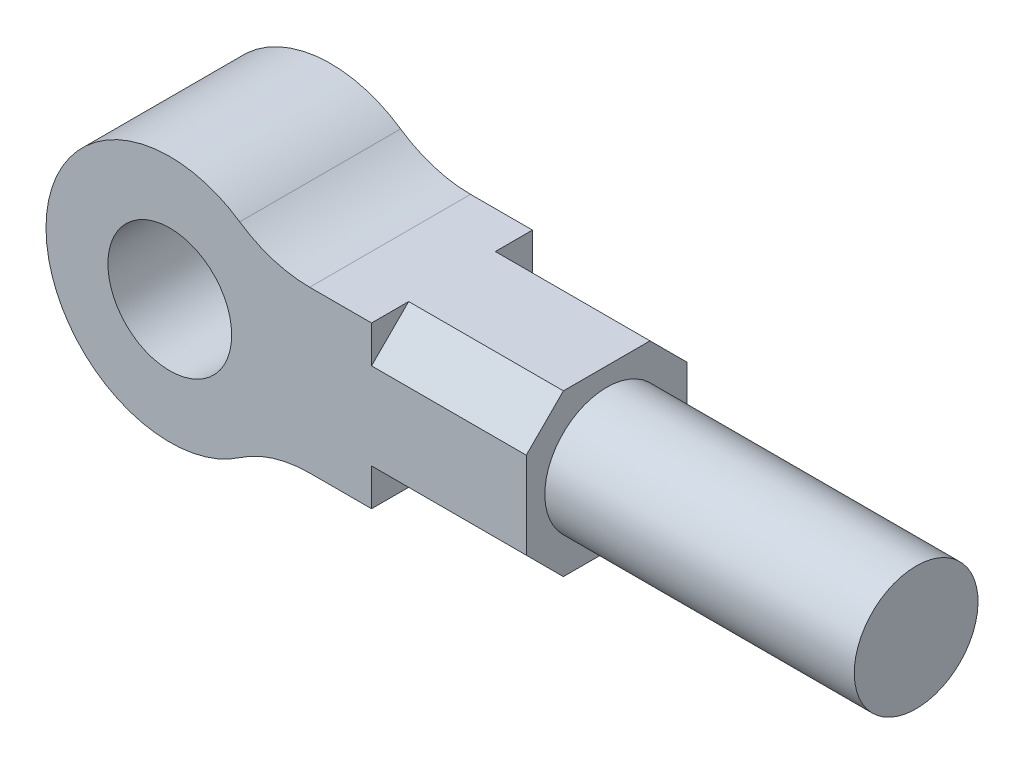
ISO-10303-21;
HEADER;
FILE_DESCRIPTION(('STEP AP214'),'2;1');
FILE_NAME('part.step','',(''),(''),'','','');
FILE_SCHEMA(('AUTOMOTIVE_DESIGN { 1 0 10303 214 1 1 1 1 }'));
ENDSEC;
DATA;
#1=APPLICATION_CONTEXT('core data for automotive mechanical design processes');
#2=APPLICATION_PROTOCOL_DEFINITION('international standard','automotive_design',2000,#1);
#3=PRODUCT_CONTEXT('',#1,'mechanical');
#4=PRODUCT('Part','Part','',(#3));
#5=PRODUCT_RELATED_PRODUCT_CATEGORY('part','',(#4));
#6=PRODUCT_DEFINITION_FORMATION('','',#4);
#7=PRODUCT_DEFINITION_CONTEXT('part definition',#1,'design');
#8=PRODUCT_DEFINITION('design','',#6,#7);
#9=PRODUCT_DEFINITION_SHAPE('','',#8);
#10=(LENGTH_UNIT() NAMED_UNIT(*) SI_UNIT(.MILLI.,.METRE.));
#11=(NAMED_UNIT(*) PLANE_ANGLE_UNIT() SI_UNIT($,.RADIAN.));
#12=(NAMED_UNIT(*) SI_UNIT($,.STERADIAN.) SOLID_ANGLE_UNIT());
#13=UNCERTAINTY_MEASURE_WITH_UNIT(LENGTH_MEASURE(1.E-05),#10,'distance_accuracy_value','');
#14=(GEOMETRIC_REPRESENTATION_CONTEXT(3) GLOBAL_UNCERTAINTY_ASSIGNED_CONTEXT((#13)) GLOBAL_UNIT_ASSIGNED_CONTEXT((#10,
#11,#12)) REPRESENTATION_CONTEXT('',''));
#15=CARTESIAN_POINT('',(0.,0.,0.));
#16=DIRECTION('',(0.,0.,1.));
#17=DIRECTION('',(1.,0.,0.));
#18=AXIS2_PLACEMENT_3D('',#15,#16,#17);
#19=CARTESIAN_POINT('',(22.6053091109146,-33.,13.));
#20=DIRECTION('',(0.,0.,1.));
#21=DIRECTION('',(1.,0.,0.));
#22=AXIS2_PLACEMENT_3D('',#19,#20,#21);
#23=PLANE('',#22);
#24=DIRECTION('',(1.,0.,0.));
#25=VECTOR('',#24,1.);
#26=CARTESIAN_POINT('',(32.6053091109146,6.99999999999963,13.));
#27=LINE('',#26,#25);
#28=CARTESIAN_POINT('',(32.6053091109146,6.99999999999963,13.));
#29=VERTEX_POINT('',#28);
#30=CARTESIAN_POINT('',(57.6053091109146,6.9999999999996,13.));
#31=VERTEX_POINT('',#30);
#32=EDGE_CURVE('E267',#29,#31,#27,.T.);
#33=ORIENTED_EDGE('',*,*,#32,.F.);
#34=DIRECTION('',(0.,-1.,0.));
#35=VECTOR('',#34,1.);
#36=CARTESIAN_POINT('',(32.6053091109147,12.9999999999996,13.));
#37=LINE('',#36,#35);
#38=CARTESIAN_POINT('',(32.6053091109147,12.9999999999996,13.));
#39=VERTEX_POINT('',#38);
#40=EDGE_CURVE('E263',#39,#29,#37,.T.);
#41=ORIENTED_EDGE('',*,*,#40,.F.);
#42=DIRECTION('',(-1.,0.,0.));
#43=VECTOR('',#42,1.);
#44=CARTESIAN_POINT('',(22.6053091109146,13.,13.));
#45=LINE('',#44,#43);
#46=CARTESIAN_POINT('',(22.6053091109146,13.,13.));
#47=VERTEX_POINT('',#46);
#48=EDGE_CURVE('E214',#39,#47,#45,.T.);
#49=ORIENTED_EDGE('',*,*,#48,.T.);
#50=CARTESIAN_POINT('',(22.6053091109146,33.,13.));
#51=DIRECTION('',(0.,0.,-1.));
#52=DIRECTION('',(-1.,0.,0.));
#53=AXIS2_PLACEMENT_3D('',#50,#51,#52);
#54=CIRCLE('',#53,20.);
#55=CARTESIAN_POINT('',(11.3026545554573,16.5,13.));
#56=VERTEX_POINT('',#55);
#57=EDGE_CURVE('E211',#47,#56,#54,.T.);
#58=ORIENTED_EDGE('',*,*,#57,.T.);
#59=CARTESIAN_POINT('',(0.,0.,13.));
#60=DIRECTION('',(0.,0.,1.));
#61=DIRECTION('',(1.,0.,0.));
#62=AXIS2_PLACEMENT_3D('',#59,#60,#61);
#63=CIRCLE('',#62,20.);
#64=CARTESIAN_POINT('',(11.3026545554573,-16.5,13.));
#65=VERTEX_POINT('',#64);
#66=EDGE_CURVE('E187',#56,#65,#63,.T.);
#67=ORIENTED_EDGE('',*,*,#66,.T.);
#68=CARTESIAN_POINT('',(22.6053091109146,-33.,13.));
#69=DIRECTION('',(0.,0.,-1.));
#70=DIRECTION('',(1.,0.,0.));
#71=AXIS2_PLACEMENT_3D('',#68,#69,#70);
#72=CIRCLE('',#71,20.);
#73=CARTESIAN_POINT('',(22.6053091109146,-13.,13.));
#74=VERTEX_POINT('',#73);
#75=EDGE_CURVE('E191',#65,#74,#72,.T.);
#76=ORIENTED_EDGE('',*,*,#75,.T.);
#77=DIRECTION('',(1.,0.,0.));
#78=VECTOR('',#77,1.);
#79=CARTESIAN_POINT('',(22.6053091109146,-13.,13.));
#80=LINE('',#79,#78);
#81=CARTESIAN_POINT('',(32.6053091109146,-13.,13.));
#82=VERTEX_POINT('',#81);
#83=EDGE_CURVE('E221',#74,#82,#80,.T.);
#84=ORIENTED_EDGE('',*,*,#83,.T.);
#85=DIRECTION('',(0.,-1.,0.));
#86=VECTOR('',#85,1.);
#87=CARTESIAN_POINT('',(32.6053091109146,0.,13.));
#88=LINE('',#87,#86);
#89=CARTESIAN_POINT('',(32.6053091109146,-6.99999999999997,13.));
#90=VERTEX_POINT('',#89);
#91=EDGE_CURVE('E286',#90,#82,#88,.T.);
#92=ORIENTED_EDGE('',*,*,#91,.F.);
#93=DIRECTION('',(1.,0.,0.));
#94=VECTOR('',#93,1.);
#95=CARTESIAN_POINT('',(32.6053091109146,-6.99999999999997,13.));
#96=LINE('',#95,#94);
#97=CARTESIAN_POINT('',(57.6053091109146,-7.,13.));
#98=VERTEX_POINT('',#97);
#99=EDGE_CURVE('E270',#90,#98,#96,.T.);
#100=ORIENTED_EDGE('',*,*,#99,.T.);
#101=DIRECTION('',(0.,1.,0.));
#102=VECTOR('',#101,1.);
#103=CARTESIAN_POINT('',(57.6053091109147,13.,13.));
#104=LINE('',#103,#102);
#105=EDGE_CURVE('E217',#98,#31,#104,.T.);
#106=ORIENTED_EDGE('',*,*,#105,.T.);
#107=EDGE_LOOP('',(#33,#41,#49,#58,#67,#76,#84,#92,#100,#106));
#108=FACE_BOUND('',#107,.T.);
#109=CARTESIAN_POINT('',(0.,0.,13.));
#110=DIRECTION('',(0.,0.,1.));
#111=DIRECTION('',(1.,0.,0.));
#112=AXIS2_PLACEMENT_3D('',#109,#110,#111);
#113=CIRCLE('',#112,10.);
#114=CARTESIAN_POINT('',(10.,0.,13.));
#115=VERTEX_POINT('',#114);
#116=EDGE_CURVE('E208',#115,#115,#113,.T.);
#117=ORIENTED_EDGE('',*,*,#116,.F.);
#118=EDGE_LOOP('',(#117));
#119=FACE_BOUND('',#118,.T.);
#120=ADVANCED_FACE('F41',(#108,#119),#23,.T.);
#121=CARTESIAN_POINT('',(22.6053091109146,-33.,-13.));
#122=DIRECTION('',(0.,0.,1.));
#123=DIRECTION('',(1.,0.,0.));
#124=AXIS2_PLACEMENT_3D('',#121,#122,#123);
#125=PLANE('',#124);
#126=DIRECTION('',(0.,1.,0.));
#127=VECTOR('',#126,1.);
#128=CARTESIAN_POINT('',(57.6053091109147,13.,-13.));
#129=LINE('',#128,#127);
#130=CARTESIAN_POINT('',(57.6053091109146,-7.00000000000037,-13.));
#131=VERTEX_POINT('',#130);
#132=CARTESIAN_POINT('',(57.6053091109146,6.99999999999996,-13.));
#133=VERTEX_POINT('',#132);
#134=EDGE_CURVE('E198',#131,#133,#129,.T.);
#135=ORIENTED_EDGE('',*,*,#134,.F.);
#136=DIRECTION('',(1.,0.,0.));
#137=VECTOR('',#136,1.);
#138=CARTESIAN_POINT('',(32.6053091109146,-7.00000000000034,-13.));
#139=LINE('',#138,#137);
#140=CARTESIAN_POINT('',(32.6053091109146,-7.00000000000034,-13.));
#141=VERTEX_POINT('',#140);
#142=EDGE_CURVE('E66',#141,#131,#139,.T.);
#143=ORIENTED_EDGE('',*,*,#142,.F.);
#144=DIRECTION('',(0.,1.,0.));
#145=VECTOR('',#144,1.);
#146=CARTESIAN_POINT('',(32.6053091109146,0.,-13.));
#147=LINE('',#146,#145);
#148=CARTESIAN_POINT('',(32.6053091109146,-13.,-13.));
#149=VERTEX_POINT('',#148);
#150=EDGE_CURVE('E152',#149,#141,#147,.T.);
#151=ORIENTED_EDGE('',*,*,#150,.F.);
#152=DIRECTION('',(1.,0.,0.));
#153=VECTOR('',#152,1.);
#154=CARTESIAN_POINT('',(22.6053091109146,-13.,-13.));
#155=LINE('',#154,#153);
#156=CARTESIAN_POINT('',(22.6053091109146,-13.,-13.));
#157=VERTEX_POINT('',#156);
#158=EDGE_CURVE('E201',#157,#149,#155,.T.);
#159=ORIENTED_EDGE('',*,*,#158,.F.);
#160=CARTESIAN_POINT('',(22.6053091109146,-33.,-13.));
#161=DIRECTION('',(0.,0.,-1.));
#162=DIRECTION('',(1.,0.,0.));
#163=AXIS2_PLACEMENT_3D('',#160,#161,#162);
#164=CIRCLE('',#163,20.);
#165=CARTESIAN_POINT('',(11.3026545554573,-16.5,-13.));
#166=VERTEX_POINT('',#165);
#167=EDGE_CURVE('E204',#166,#157,#164,.T.);
#168=ORIENTED_EDGE('',*,*,#167,.F.);
#169=CARTESIAN_POINT('',(0.,0.,-13.));
#170=DIRECTION('',(0.,0.,1.));
#171=DIRECTION('',(1.,0.,0.));
#172=AXIS2_PLACEMENT_3D('',#169,#170,#171);
#173=CIRCLE('',#172,20.);
#174=CARTESIAN_POINT('',(11.3026545554573,16.5,-13.));
#175=VERTEX_POINT('',#174);
#176=EDGE_CURVE('E188',#175,#166,#173,.T.);
#177=ORIENTED_EDGE('',*,*,#176,.F.);
#178=CARTESIAN_POINT('',(22.6053091109146,33.,-13.));
#179=DIRECTION('',(0.,0.,-1.));
#180=DIRECTION('',(-1.,0.,0.));
#181=AXIS2_PLACEMENT_3D('',#178,#179,#180);
#182=CIRCLE('',#181,20.);
#183=CARTESIAN_POINT('',(22.6053091109146,13.,-13.));
#184=VERTEX_POINT('',#183);
#185=EDGE_CURVE('E192',#184,#175,#182,.T.);
#186=ORIENTED_EDGE('',*,*,#185,.F.);
#187=DIRECTION('',(-1.,0.,0.));
#188=VECTOR('',#187,1.);
#189=CARTESIAN_POINT('',(22.6053091109146,13.,-13.));
#190=LINE('',#189,#188);
#191=CARTESIAN_POINT('',(32.6053091109147,13.,-13.));
#192=VERTEX_POINT('',#191);
#193=EDGE_CURVE('E195',#192,#184,#190,.T.);
#194=ORIENTED_EDGE('',*,*,#193,.F.);
#195=DIRECTION('',(0.,1.,0.));
#196=VECTOR('',#195,1.);
#197=CARTESIAN_POINT('',(32.6053091109146,0.,-13.));
#198=LINE('',#197,#196);
#199=CARTESIAN_POINT('',(32.6053091109146,6.99999999999999,-13.));
#200=VERTEX_POINT('',#199);
#201=EDGE_CURVE('E239',#200,#192,#198,.T.);
#202=ORIENTED_EDGE('',*,*,#201,.F.);
#203=DIRECTION('',(1.,0.,0.));
#204=VECTOR('',#203,1.);
#205=CARTESIAN_POINT('',(32.6053091109146,6.99999999999999,-13.));
#206=LINE('',#205,#204);
#207=EDGE_CURVE('E232',#200,#133,#206,.T.);
#208=ORIENTED_EDGE('',*,*,#207,.T.);
#209=EDGE_LOOP('',(#135,#143,#151,#159,#168,#177,#186,#194,#202,#208));
#210=FACE_BOUND('',#209,.T.);
#211=CARTESIAN_POINT('',(0.,0.,-13.));
#212=DIRECTION('',(0.,0.,1.));
#213=DIRECTION('',(1.,0.,0.));
#214=AXIS2_PLACEMENT_3D('',#211,#212,#213);
#215=CIRCLE('',#214,10.);
#216=CARTESIAN_POINT('',(10.,0.,-13.));
#217=VERTEX_POINT('',#216);
#218=EDGE_CURVE('E228',#217,#217,#215,.T.);
#219=ORIENTED_EDGE('',*,*,#218,.T.);
#220=EDGE_LOOP('',(#219));
#221=FACE_BOUND('',#220,.T.);
#222=ADVANCED_FACE('F330',(#210,#221),#125,.F.);
#223=CARTESIAN_POINT('',(22.6053091109146,-33.,13.));
#224=DIRECTION('',(0.,0.,-1.));
#225=DIRECTION('',(-1.,0.,0.));
#226=AXIS2_PLACEMENT_3D('',#223,#224,#225);
#227=CYLINDRICAL_SURFACE('',#226,20.);
#228=ORIENTED_EDGE('',*,*,#167,.T.);
#229=DIRECTION('',(0.,0.,-1.));
#230=VECTOR('',#229,1.);
#231=CARTESIAN_POINT('',(22.6053091109146,-13.,13.));
#232=LINE('',#231,#230);
#233=EDGE_CURVE('E45',#74,#157,#232,.T.);
#234=ORIENTED_EDGE('',*,*,#233,.F.);
#235=ORIENTED_EDGE('',*,*,#75,.F.);
#236=DIRECTION('',(0.,0.,-1.));
#237=VECTOR('',#236,1.);
#238=CARTESIAN_POINT('',(11.3026545554573,-16.5,13.));
#239=LINE('',#238,#237);
#240=EDGE_CURVE('E183',#65,#166,#239,.T.);
#241=ORIENTED_EDGE('',*,*,#240,.T.);
#242=EDGE_LOOP('',(#228,#234,#235,#241));
#243=FACE_BOUND('',#242,.T.);
#244=ADVANCED_FACE('F43',(#243),#227,.F.);
#245=CARTESIAN_POINT('',(22.6053091109146,-13.,13.));
#246=DIRECTION('',(0.,1.,0.));
#247=DIRECTION('',(-1.,0.,0.));
#248=AXIS2_PLACEMENT_3D('',#245,#246,#247);
#249=PLANE('',#248);
#250=DIRECTION('',(0.,0.,-1.));
#251=VECTOR('',#250,1.);
#252=CARTESIAN_POINT('',(57.6053091109146,-13.,13.));
#253=LINE('',#252,#251);
#254=CARTESIAN_POINT('',(57.6053091109146,-13.,6.99999999999998));
#255=VERTEX_POINT('',#254);
#256=CARTESIAN_POINT('',(57.6053091109146,-13.,-7.00000000000036));
#257=VERTEX_POINT('',#256);
#258=EDGE_CURVE('E158',#255,#257,#253,.T.);
#259=ORIENTED_EDGE('',*,*,#258,.F.);
#260=DIRECTION('',(1.,0.,0.));
#261=VECTOR('',#260,1.);
#262=CARTESIAN_POINT('',(32.6053091109146,-13.,6.99999999999998));
#263=LINE('',#262,#261);
#264=CARTESIAN_POINT('',(32.6053091109146,-13.,6.99999999999998));
#265=VERTEX_POINT('',#264);
#266=EDGE_CURVE('E58',#265,#255,#263,.T.);
#267=ORIENTED_EDGE('',*,*,#266,.F.);
#268=DIRECTION('',(0.,0.,-1.));
#269=VECTOR('',#268,1.);
#270=CARTESIAN_POINT('',(32.6053091109146,-13.,0.));
#271=LINE('',#270,#269);
#272=EDGE_CURVE('E278',#82,#265,#271,.T.);
#273=ORIENTED_EDGE('',*,*,#272,.F.);
#274=ORIENTED_EDGE('',*,*,#83,.F.);
#275=ORIENTED_EDGE('',*,*,#233,.T.);
#276=ORIENTED_EDGE('',*,*,#158,.T.);
#277=DIRECTION('',(0.,0.,-1.));
#278=VECTOR('',#277,1.);
#279=CARTESIAN_POINT('',(32.6053091109146,-13.,0.));
#280=LINE('',#279,#278);
#281=CARTESIAN_POINT('',(32.6053091109146,-13.,-7.00000000000036));
#282=VERTEX_POINT('',#281);
#283=EDGE_CURVE('E160',#282,#149,#280,.T.);
#284=ORIENTED_EDGE('',*,*,#283,.F.);
#285=DIRECTION('',(1.,0.,0.));
#286=VECTOR('',#285,1.);
#287=CARTESIAN_POINT('',(32.6053091109146,-13.,-7.00000000000036));
#288=LINE('',#287,#286);
#289=EDGE_CURVE('E144',#282,#257,#288,.T.);
#290=ORIENTED_EDGE('',*,*,#289,.T.);
#291=EDGE_LOOP('',(#259,#267,#273,#274,#275,#276,#284,#290));
#292=FACE_BOUND('',#291,.T.);
#293=ADVANCED_FACE('F157',(#292),#249,.F.);
#294=CARTESIAN_POINT('',(57.6053091109147,13.,13.));
#295=DIRECTION('',(-1.,0.,0.));
#296=DIRECTION('',(0.,-1.,0.));
#297=AXIS2_PLACEMENT_3D('',#294,#295,#296);
#298=PLANE('',#297);
#299=CARTESIAN_POINT('',(57.6053091109146,0.,0.));
#300=DIRECTION('',(1.,0.,0.));
#301=DIRECTION('',(0.,1.,0.));
#302=AXIS2_PLACEMENT_3D('',#299,#300,#301);
#303=CIRCLE('',#302,10.);
#304=CARTESIAN_POINT('',(57.6053091109146,9.99999999999994,0.));
#305=VERTEX_POINT('',#304);
#306=EDGE_CURVE('E11',#305,#305,#303,.T.);
#307=ORIENTED_EDGE('',*,*,#306,.F.);
#308=EDGE_LOOP('',(#307));
#309=FACE_BOUND('',#308,.T.);
#310=DIRECTION('',(0.,0.,-1.));
#311=VECTOR('',#310,1.);
#312=CARTESIAN_POINT('',(57.6053091109147,13.,13.));
#313=LINE('',#312,#311);
#314=CARTESIAN_POINT('',(57.6053091109147,12.9999999999996,6.99999999999998));
#315=VERTEX_POINT('',#314);
#316=CARTESIAN_POINT('',(57.6053091109147,13.,-7.));
#317=VERTEX_POINT('',#316);
#318=EDGE_CURVE('E168',#315,#317,#313,.T.);
#319=ORIENTED_EDGE('',*,*,#318,.F.);
#320=DIRECTION('',(0.,0.707106781186548,-0.707106781186547));
#321=VECTOR('',#320,1.);
#322=CARTESIAN_POINT('',(57.6053091109146,6.9999999999996,13.));
#323=LINE('',#322,#321);
#324=EDGE_CURVE('E259',#31,#315,#323,.T.);
#325=ORIENTED_EDGE('',*,*,#324,.F.);
#326=ORIENTED_EDGE('',*,*,#105,.F.);
#327=DIRECTION('',(0.,0.707106781186547,0.707106781186548));
#328=VECTOR('',#327,1.);
#329=CARTESIAN_POINT('',(57.6053091109146,-10.,9.99999999999997));
#330=LINE('',#329,#328);
#331=EDGE_CURVE('E162',#255,#98,#330,.T.);
#332=ORIENTED_EDGE('',*,*,#331,.F.);
#333=ORIENTED_EDGE('',*,*,#258,.T.);
#334=DIRECTION('',(0.,-0.707106781186548,0.707106781186548));
#335=VECTOR('',#334,1.);
#336=CARTESIAN_POINT('',(57.6053091109146,-10.0000000000002,-10.0000000000002));
#337=LINE('',#336,#335);
#338=EDGE_CURVE('E141',#131,#257,#337,.T.);
#339=ORIENTED_EDGE('',*,*,#338,.F.);
#340=ORIENTED_EDGE('',*,*,#134,.T.);
#341=DIRECTION('',(0.,-0.707106781186548,-0.707106781186547));
#342=VECTOR('',#341,1.);
#343=CARTESIAN_POINT('',(57.6053091109146,9.99999999999995,-10.));
#344=LINE('',#343,#342);
#345=EDGE_CURVE('E151',#317,#133,#344,.T.);
#346=ORIENTED_EDGE('',*,*,#345,.F.);
#347=EDGE_LOOP('',(#319,#325,#326,#332,#333,#339,#340,#346));
#348=FACE_BOUND('',#347,.T.);
#349=ADVANCED_FACE('F165',(#309,#348),#298,.F.);
#350=CARTESIAN_POINT('',(22.6053091109146,13.,13.));
#351=DIRECTION('',(0.,-1.,0.));
#352=DIRECTION('',(1.,0.,0.));
#353=AXIS2_PLACEMENT_3D('',#350,#351,#352);
#354=PLANE('',#353);
#355=DIRECTION('',(0.,0.,-1.));
#356=VECTOR('',#355,1.);
#357=CARTESIAN_POINT('',(32.6053091109147,12.9999999999996,13.));
#358=LINE('',#357,#356);
#359=CARTESIAN_POINT('',(32.6053091109147,13.,6.99999999999998));
#360=VERTEX_POINT('',#359);
#361=EDGE_CURVE('E255',#39,#360,#358,.T.);
#362=ORIENTED_EDGE('',*,*,#361,.T.);
#363=DIRECTION('',(1.,0.,0.));
#364=VECTOR('',#363,1.);
#365=CARTESIAN_POINT('',(32.6053091109147,12.9999999999996,6.99999999999998));
#366=LINE('',#365,#364);
#367=EDGE_CURVE('E273',#360,#315,#366,.T.);
#368=ORIENTED_EDGE('',*,*,#367,.T.);
#369=ORIENTED_EDGE('',*,*,#318,.T.);
#370=DIRECTION('',(1.,0.,0.));
#371=VECTOR('',#370,1.);
#372=CARTESIAN_POINT('',(32.6053091109147,13.,-7.));
#373=LINE('',#372,#371);
#374=CARTESIAN_POINT('',(32.6053091109147,13.,-7.));
#375=VERTEX_POINT('',#374);
#376=EDGE_CURVE('E236',#375,#317,#373,.T.);
#377=ORIENTED_EDGE('',*,*,#376,.F.);
#378=DIRECTION('',(0.,0.,1.));
#379=VECTOR('',#378,1.);
#380=CARTESIAN_POINT('',(32.6053091109147,13.,0.));
#381=LINE('',#380,#379);
#382=EDGE_CURVE('E245',#192,#375,#381,.T.);
#383=ORIENTED_EDGE('',*,*,#382,.F.);
#384=ORIENTED_EDGE('',*,*,#193,.T.);
#385=DIRECTION('',(0.,0.,-1.));
#386=VECTOR('',#385,1.);
#387=CARTESIAN_POINT('',(22.6053091109146,13.,13.));
#388=LINE('',#387,#386);
#389=EDGE_CURVE('E173',#47,#184,#388,.T.);
#390=ORIENTED_EDGE('',*,*,#389,.F.);
#391=ORIENTED_EDGE('',*,*,#48,.F.);
#392=EDGE_LOOP('',(#362,#368,#369,#377,#383,#384,#390,#391));
#393=FACE_BOUND('',#392,.T.);
#394=ADVANCED_FACE('F320',(#393),#354,.F.);
#395=CARTESIAN_POINT('',(22.6053091109146,33.,13.));
#396=DIRECTION('',(0.,0.,-1.));
#397=DIRECTION('',(-1.,0.,0.));
#398=AXIS2_PLACEMENT_3D('',#395,#396,#397);
#399=CYLINDRICAL_SURFACE('',#398,20.);
#400=ORIENTED_EDGE('',*,*,#185,.T.);
#401=DIRECTION('',(0.,0.,-1.));
#402=VECTOR('',#401,1.);
#403=CARTESIAN_POINT('',(11.3026545554573,16.5,13.));
#404=LINE('',#403,#402);
#405=EDGE_CURVE('E179',#56,#175,#404,.T.);
#406=ORIENTED_EDGE('',*,*,#405,.F.);
#407=ORIENTED_EDGE('',*,*,#57,.F.);
#408=ORIENTED_EDGE('',*,*,#389,.T.);
#409=EDGE_LOOP('',(#400,#406,#407,#408));
#410=FACE_BOUND('',#409,.T.);
#411=ADVANCED_FACE('F326',(#410),#399,.F.);
#412=CARTESIAN_POINT('',(0.,0.,13.));
#413=DIRECTION('',(0.,0.,-1.));
#414=DIRECTION('',(-1.,0.,0.));
#415=AXIS2_PLACEMENT_3D('',#412,#413,#414);
#416=CYLINDRICAL_SURFACE('',#415,20.);
#417=ORIENTED_EDGE('',*,*,#176,.T.);
#418=ORIENTED_EDGE('',*,*,#240,.F.);
#419=ORIENTED_EDGE('',*,*,#66,.F.);
#420=ORIENTED_EDGE('',*,*,#405,.T.);
#421=EDGE_LOOP('',(#417,#418,#419,#420));
#422=FACE_BOUND('',#421,.T.);
#423=ADVANCED_FACE('F344',(#422),#416,.T.);
#424=CARTESIAN_POINT('',(0.,0.,13.));
#425=DIRECTION('',(0.,0.,-1.));
#426=DIRECTION('',(-1.,0.,0.));
#427=AXIS2_PLACEMENT_3D('',#424,#425,#426);
#428=CYLINDRICAL_SURFACE('',#427,10.);
#429=ORIENTED_EDGE('',*,*,#116,.T.);
#430=EDGE_LOOP('',(#429));
#431=FACE_BOUND('',#430,.T.);
#432=ORIENTED_EDGE('',*,*,#218,.F.);
#433=EDGE_LOOP('',(#432));
#434=FACE_BOUND('',#433,.T.);
#435=ADVANCED_FACE('F341',(#431,#434),#428,.F.);
#436=CARTESIAN_POINT('',(32.6053091109146,9.99999999999998,-10.));
#437=DIRECTION('',(0.,-0.707106781186547,0.707106781186548));
#438=DIRECTION('',(0.,-0.707106781186548,-0.707106781186547));
#439=AXIS2_PLACEMENT_3D('',#436,#437,#438);
#440=PLANE('',#439);
#441=ORIENTED_EDGE('',*,*,#345,.T.);
#442=ORIENTED_EDGE('',*,*,#207,.F.);
#443=DIRECTION('',(0.,-0.707106781186548,-0.707106781186547));
#444=VECTOR('',#443,1.);
#445=CARTESIAN_POINT('',(32.6053091109146,9.99999999999998,-10.));
#446=LINE('',#445,#444);
#447=EDGE_CURVE('E248',#375,#200,#446,.T.);
#448=ORIENTED_EDGE('',*,*,#447,.F.);
#449=ORIENTED_EDGE('',*,*,#376,.T.);
#450=EDGE_LOOP('',(#441,#442,#448,#449));
#451=FACE_BOUND('',#450,.T.);
#452=ADVANCED_FACE('F375',(#451),#440,.F.);
#453=CARTESIAN_POINT('',(32.6053091109146,0.,0.));
#454=DIRECTION('',(1.,0.,0.));
#455=DIRECTION('',(0.,1.,0.));
#456=AXIS2_PLACEMENT_3D('',#453,#454,#455);
#457=PLANE('',#456);
#458=ORIENTED_EDGE('',*,*,#382,.T.);
#459=ORIENTED_EDGE('',*,*,#447,.T.);
#460=ORIENTED_EDGE('',*,*,#201,.T.);
#461=EDGE_LOOP('',(#458,#459,#460));
#462=FACE_BOUND('',#461,.T.);
#463=ADVANCED_FACE('F373',(#462),#457,.T.);
#464=CARTESIAN_POINT('',(32.6053091109146,6.99999999999963,13.));
#465=DIRECTION('',(0.,-0.707106781186547,-0.707106781186548));
#466=DIRECTION('',(0.,0.707106781186548,-0.707106781186547));
#467=AXIS2_PLACEMENT_3D('',#464,#465,#466);
#468=PLANE('',#467);
#469=ORIENTED_EDGE('',*,*,#324,.T.);
#470=ORIENTED_EDGE('',*,*,#367,.F.);
#471=DIRECTION('',(0.,0.707106781186548,-0.707106781186547));
#472=VECTOR('',#471,1.);
#473=CARTESIAN_POINT('',(32.6053091109146,6.99999999999963,13.));
#474=LINE('',#473,#472);
#475=EDGE_CURVE('E260',#29,#360,#474,.T.);
#476=ORIENTED_EDGE('',*,*,#475,.F.);
#477=ORIENTED_EDGE('',*,*,#32,.T.);
#478=EDGE_LOOP('',(#469,#470,#476,#477));
#479=FACE_BOUND('',#478,.T.);
#480=ADVANCED_FACE('F380',(#479),#468,.F.);
#481=CARTESIAN_POINT('',(32.6053091109146,0.,0.));
#482=DIRECTION('',(-1.,0.,0.));
#483=DIRECTION('',(0.,-1.,0.));
#484=AXIS2_PLACEMENT_3D('',#481,#482,#483);
#485=PLANE('',#484);
#486=ORIENTED_EDGE('',*,*,#361,.F.);
#487=ORIENTED_EDGE('',*,*,#40,.T.);
#488=ORIENTED_EDGE('',*,*,#475,.T.);
#489=EDGE_LOOP('',(#486,#487,#488));
#490=FACE_BOUND('',#489,.T.);
#491=ADVANCED_FACE('F395',(#490),#485,.F.);
#492=CARTESIAN_POINT('',(32.6053091109146,-10.0000000000002,-10.0000000000002));
#493=DIRECTION('',(0.,0.707106781186548,0.707106781186548));
#494=DIRECTION('',(0.,-0.707106781186548,0.707106781186548));
#495=AXIS2_PLACEMENT_3D('',#492,#493,#494);
#496=PLANE('',#495);
#497=ORIENTED_EDGE('',*,*,#338,.T.);
#498=ORIENTED_EDGE('',*,*,#289,.F.);
#499=DIRECTION('',(0.,-0.707106781186548,0.707106781186548));
#500=VECTOR('',#499,1.);
#501=CARTESIAN_POINT('',(32.6053091109146,-10.0000000000002,-10.0000000000002));
#502=LINE('',#501,#500);
#503=EDGE_CURVE('E299',#141,#282,#502,.T.);
#504=ORIENTED_EDGE('',*,*,#503,.F.);
#505=ORIENTED_EDGE('',*,*,#142,.T.);
#506=EDGE_LOOP('',(#497,#498,#504,#505));
#507=FACE_BOUND('',#506,.T.);
#508=ADVANCED_FACE('F143',(#507),#496,.F.);
#509=CARTESIAN_POINT('',(32.6053091109146,0.,0.));
#510=DIRECTION('',(1.,0.,0.));
#511=DIRECTION('',(0.,1.,0.));
#512=AXIS2_PLACEMENT_3D('',#509,#510,#511);
#513=PLANE('',#512);
#514=ORIENTED_EDGE('',*,*,#150,.T.);
#515=ORIENTED_EDGE('',*,*,#503,.T.);
#516=ORIENTED_EDGE('',*,*,#283,.T.);
#517=EDGE_LOOP('',(#514,#515,#516));
#518=FACE_BOUND('',#517,.T.);
#519=ADVANCED_FACE('F389',(#518),#513,.T.);
#520=CARTESIAN_POINT('',(32.6053091109146,-10.,9.99999999999997));
#521=DIRECTION('',(0.,0.707106781186548,-0.707106781186547));
#522=DIRECTION('',(0.,0.707106781186547,0.707106781186548));
#523=AXIS2_PLACEMENT_3D('',#520,#521,#522);
#524=PLANE('',#523);
#525=ORIENTED_EDGE('',*,*,#331,.T.);
#526=ORIENTED_EDGE('',*,*,#99,.F.);
#527=DIRECTION('',(0.,0.707106781186547,0.707106781186548));
#528=VECTOR('',#527,1.);
#529=CARTESIAN_POINT('',(32.6053091109146,-10.,9.99999999999997));
#530=LINE('',#529,#528);
#531=EDGE_CURVE('E282',#265,#90,#530,.T.);
#532=ORIENTED_EDGE('',*,*,#531,.F.);
#533=ORIENTED_EDGE('',*,*,#266,.T.);
#534=EDGE_LOOP('',(#525,#526,#532,#533));
#535=FACE_BOUND('',#534,.T.);
#536=ADVANCED_FACE('F381',(#535),#524,.F.);
#537=CARTESIAN_POINT('',(32.6053091109146,0.,0.));
#538=DIRECTION('',(1.,0.,0.));
#539=DIRECTION('',(0.,1.,0.));
#540=AXIS2_PLACEMENT_3D('',#537,#538,#539);
#541=PLANE('',#540);
#542=ORIENTED_EDGE('',*,*,#272,.T.);
#543=ORIENTED_EDGE('',*,*,#531,.T.);
#544=ORIENTED_EDGE('',*,*,#91,.T.);
#545=EDGE_LOOP('',(#542,#543,#544));
#546=FACE_BOUND('',#545,.T.);
#547=ADVANCED_FACE('F315',(#546),#541,.T.);
#548=CARTESIAN_POINT('',(107.605309110915,-1.14871049756581E-13,0.));
#549=DIRECTION('',(-1.,0.,0.));
#550=DIRECTION('',(0.,-1.,0.));
#551=AXIS2_PLACEMENT_3D('',#548,#549,#550);
#552=CYLINDRICAL_SURFACE('',#551,10.);
#553=CARTESIAN_POINT('',(107.605309110915,-1.14871049756581E-13,0.));
#554=DIRECTION('',(1.,0.,0.));
#555=DIRECTION('',(0.,1.,0.));
#556=AXIS2_PLACEMENT_3D('',#553,#554,#555);
#557=CIRCLE('',#556,10.);
#558=CARTESIAN_POINT('',(107.605309110915,9.99999999999989,0.));
#559=VERTEX_POINT('',#558);
#560=EDGE_CURVE('E277',#559,#559,#557,.T.);
#561=ORIENTED_EDGE('',*,*,#560,.F.);
#562=EDGE_LOOP('',(#561));
#563=FACE_BOUND('',#562,.T.);
#564=ORIENTED_EDGE('',*,*,#306,.T.);
#565=EDGE_LOOP('',(#564));
#566=FACE_BOUND('',#565,.T.);
#567=ADVANCED_FACE('F312',(#563,#566),#552,.T.);
#568=CARTESIAN_POINT('',(107.605309110915,-1.09005523921499E-13,0.));
#569=DIRECTION('',(1.,0.,0.));
#570=DIRECTION('',(0.,1.,0.));
#571=AXIS2_PLACEMENT_3D('',#568,#569,#570);
#572=PLANE('',#571);
#573=ORIENTED_EDGE('',*,*,#560,.T.);
#574=EDGE_LOOP('',(#573));
#575=FACE_BOUND('',#574,.T.);
#576=ADVANCED_FACE('F310',(#575),#572,.T.);
#577=CLOSED_SHELL('',(#120,#222,#244,#293,#349,#394,#411,#423,#435,#452,#463,#480,#491,#508,
#519,#536,#547,#567,#576));
#578=MANIFOLD_SOLID_BREP('B2',#577);
#579=ADVANCED_BREP_SHAPE_REPRESENTATION('',(#18,#578),#14);
#580=SHAPE_DEFINITION_REPRESENTATION(#9,#579);
ENDSEC;
END-ISO-10303-21;
